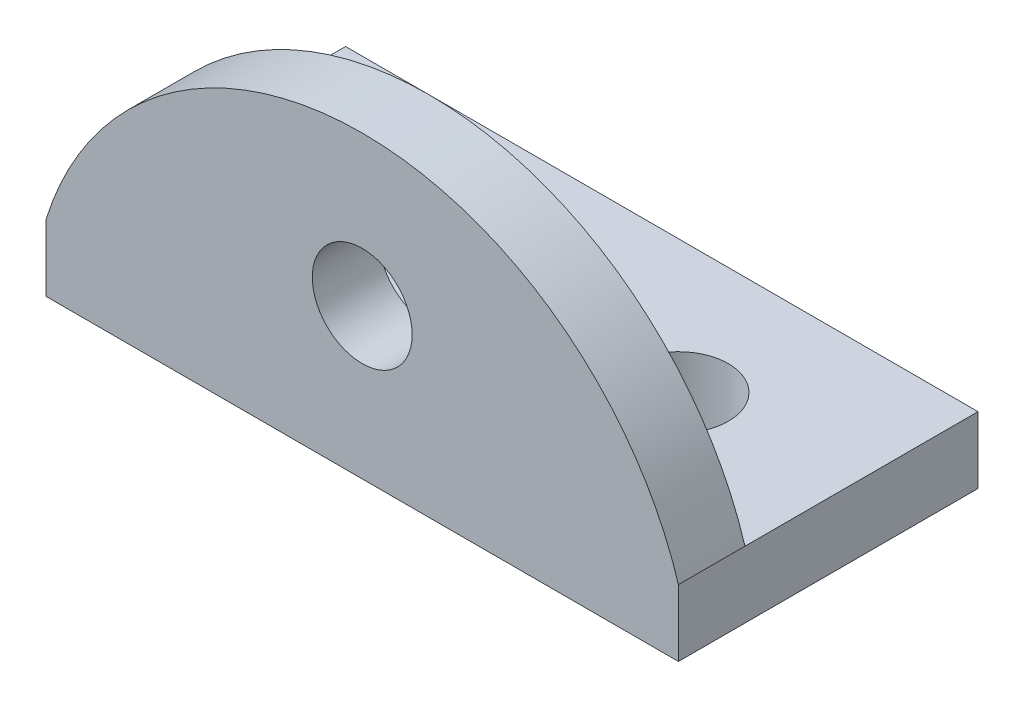
ISO-10303-21;
HEADER;
FILE_DESCRIPTION(('STEP AP214'),'2;1');
FILE_NAME('part.step','',(''),(''),'','','');
FILE_SCHEMA(('AUTOMOTIVE_DESIGN { 1 0 10303 214 1 1 1 1 }'));
ENDSEC;
DATA;
#1=APPLICATION_CONTEXT('core data for automotive mechanical design processes');
#2=APPLICATION_PROTOCOL_DEFINITION('international standard','automotive_design',2000,#1);
#3=PRODUCT_CONTEXT('',#1,'mechanical');
#4=PRODUCT('Part','Part','',(#3));
#5=PRODUCT_RELATED_PRODUCT_CATEGORY('part','',(#4));
#6=PRODUCT_DEFINITION_FORMATION('','',#4);
#7=PRODUCT_DEFINITION_CONTEXT('part definition',#1,'design');
#8=PRODUCT_DEFINITION('design','',#6,#7);
#9=PRODUCT_DEFINITION_SHAPE('','',#8);
#10=(LENGTH_UNIT() NAMED_UNIT(*) SI_UNIT(.MILLI.,.METRE.));
#11=(NAMED_UNIT(*) PLANE_ANGLE_UNIT() SI_UNIT($,.RADIAN.));
#12=(NAMED_UNIT(*) SI_UNIT($,.STERADIAN.) SOLID_ANGLE_UNIT());
#13=UNCERTAINTY_MEASURE_WITH_UNIT(LENGTH_MEASURE(1.E-05),#10,'distance_accuracy_value','');
#14=(GEOMETRIC_REPRESENTATION_CONTEXT(3) GLOBAL_UNCERTAINTY_ASSIGNED_CONTEXT((#13)) GLOBAL_UNIT_ASSIGNED_CONTEXT((#10,
#11,#12)) REPRESENTATION_CONTEXT('',''));
#15=CARTESIAN_POINT('',(0.,0.,0.));
#16=DIRECTION('',(0.,0.,1.));
#17=DIRECTION('',(1.,0.,0.));
#18=AXIS2_PLACEMENT_3D('',#15,#16,#17);
#19=CARTESIAN_POINT('',(0.,2.,0.));
#20=DIRECTION('',(1.,0.,0.));
#21=DIRECTION('',(0.,0.,-1.));
#22=AXIS2_PLACEMENT_3D('',#19,#20,#21);
#23=PLANE('',#22);
#24=DIRECTION('',(0.,0.,1.));
#25=VECTOR('',#24,1.);
#26=CARTESIAN_POINT('',(0.,0.,0.));
#27=LINE('',#26,#25);
#28=CARTESIAN_POINT('',(0.,0.,-9.));
#29=VERTEX_POINT('',#28);
#30=CARTESIAN_POINT('',(0.,0.,0.));
#31=VERTEX_POINT('',#30);
#32=EDGE_CURVE('E108',#29,#31,#27,.T.);
#33=ORIENTED_EDGE('',*,*,#32,.T.);
#34=DIRECTION('',(0.,-1.,0.));
#35=VECTOR('',#34,1.);
#36=CARTESIAN_POINT('',(0.,2.,0.));
#37=LINE('',#36,#35);
#38=CARTESIAN_POINT('',(0.,2.,0.));
#39=VERTEX_POINT('',#38);
#40=EDGE_CURVE('E11',#39,#31,#37,.T.);
#41=ORIENTED_EDGE('',*,*,#40,.F.);
#42=DIRECTION('',(0.,0.,1.));
#43=VECTOR('',#42,1.);
#44=CARTESIAN_POINT('',(0.,2.,-2.));
#45=LINE('',#44,#43);
#46=CARTESIAN_POINT('',(0.,2.,-2.));
#47=VERTEX_POINT('',#46);
#48=EDGE_CURVE('E54',#47,#39,#45,.T.);
#49=ORIENTED_EDGE('',*,*,#48,.F.);
#50=DIRECTION('',(0.,0.,1.));
#51=VECTOR('',#50,1.);
#52=CARTESIAN_POINT('',(0.,2.,0.));
#53=LINE('',#52,#51);
#54=CARTESIAN_POINT('',(0.,2.,-9.));
#55=VERTEX_POINT('',#54);
#56=EDGE_CURVE('E109',#55,#47,#53,.T.);
#57=ORIENTED_EDGE('',*,*,#56,.F.);
#58=DIRECTION('',(0.,-1.,0.));
#59=VECTOR('',#58,1.);
#60=CARTESIAN_POINT('',(0.,2.,-9.));
#61=LINE('',#60,#59);
#62=EDGE_CURVE('E113',#55,#29,#61,.T.);
#63=ORIENTED_EDGE('',*,*,#62,.T.);
#64=EDGE_LOOP('',(#33,#41,#49,#57,#63));
#65=FACE_BOUND('',#64,.T.);
#66=ADVANCED_FACE('F32',(#65),#23,.F.);
#67=CARTESIAN_POINT('',(0.,2.,0.));
#68=DIRECTION('',(0.,0.,-1.));
#69=DIRECTION('',(-1.,0.,0.));
#70=AXIS2_PLACEMENT_3D('',#67,#68,#69);
#71=PLANE('',#70);
#72=CARTESIAN_POINT('',(9.5,4.5,0.));
#73=DIRECTION('',(0.,0.,1.));
#74=DIRECTION('',(1.,0.,0.));
#75=AXIS2_PLACEMENT_3D('',#72,#73,#74);
#76=CIRCLE('',#75,1.5);
#77=CARTESIAN_POINT('',(11.,4.5,0.));
#78=VERTEX_POINT('',#77);
#79=EDGE_CURVE('E179',#78,#78,#76,.T.);
#80=ORIENTED_EDGE('',*,*,#79,.F.);
#81=EDGE_LOOP('',(#80));
#82=FACE_BOUND('',#81,.T.);
#83=DIRECTION('',(1.,0.,0.));
#84=VECTOR('',#83,1.);
#85=CARTESIAN_POINT('',(0.,0.,0.));
#86=LINE('',#85,#84);
#87=CARTESIAN_POINT('',(19.,0.,0.));
#88=VERTEX_POINT('',#87);
#89=EDGE_CURVE('E95',#31,#88,#86,.T.);
#90=ORIENTED_EDGE('',*,*,#89,.T.);
#91=DIRECTION('',(0.,-1.,0.));
#92=VECTOR('',#91,1.);
#93=CARTESIAN_POINT('',(19.,2.,0.));
#94=LINE('',#93,#92);
#95=CARTESIAN_POINT('',(19.,2.,0.));
#96=VERTEX_POINT('',#95);
#97=EDGE_CURVE('E39',#96,#88,#94,.T.);
#98=ORIENTED_EDGE('',*,*,#97,.F.);
#99=CARTESIAN_POINT('',(9.5,-0.946428571428571,0.));
#100=DIRECTION('',(0.,0.,1.));
#101=DIRECTION('',(-1.,0.,0.));
#102=AXIS2_PLACEMENT_3D('',#99,#100,#101);
#103=CIRCLE('',#102,9.94642857142857);
#104=EDGE_CURVE('E94',#96,#39,#103,.T.);
#105=ORIENTED_EDGE('',*,*,#104,.T.);
#106=ORIENTED_EDGE('',*,*,#40,.T.);
#107=EDGE_LOOP('',(#90,#98,#105,#106));
#108=FACE_BOUND('',#107,.T.);
#109=ADVANCED_FACE('F93',(#82,#108),#71,.F.);
#110=CARTESIAN_POINT('',(19.,2.,0.));
#111=DIRECTION('',(-1.,0.,0.));
#112=DIRECTION('',(0.,0.,1.));
#113=AXIS2_PLACEMENT_3D('',#110,#111,#112);
#114=PLANE('',#113);
#115=DIRECTION('',(0.,0.,-1.));
#116=VECTOR('',#115,1.);
#117=CARTESIAN_POINT('',(19.,0.,0.));
#118=LINE('',#117,#116);
#119=CARTESIAN_POINT('',(19.,0.,-9.));
#120=VERTEX_POINT('',#119);
#121=EDGE_CURVE('E117',#88,#120,#118,.T.);
#122=ORIENTED_EDGE('',*,*,#121,.T.);
#123=DIRECTION('',(0.,-1.,0.));
#124=VECTOR('',#123,1.);
#125=CARTESIAN_POINT('',(19.,2.,-9.));
#126=LINE('',#125,#124);
#127=CARTESIAN_POINT('',(19.,2.,-9.));
#128=VERTEX_POINT('',#127);
#129=EDGE_CURVE('E96',#128,#120,#126,.T.);
#130=ORIENTED_EDGE('',*,*,#129,.F.);
#131=DIRECTION('',(0.,0.,-1.));
#132=VECTOR('',#131,1.);
#133=CARTESIAN_POINT('',(19.,2.,0.));
#134=LINE('',#133,#132);
#135=CARTESIAN_POINT('',(19.,2.,-2.));
#136=VERTEX_POINT('',#135);
#137=EDGE_CURVE('E84',#136,#128,#134,.T.);
#138=ORIENTED_EDGE('',*,*,#137,.F.);
#139=EDGE_CURVE('E79',#96,#136,#134,.T.);
#140=ORIENTED_EDGE('',*,*,#139,.F.);
#141=ORIENTED_EDGE('',*,*,#97,.T.);
#142=EDGE_LOOP('',(#122,#130,#138,#140,#141));
#143=FACE_BOUND('',#142,.T.);
#144=ADVANCED_FACE('F81',(#143),#114,.F.);
#145=CARTESIAN_POINT('',(0.,2.,-9.));
#146=DIRECTION('',(0.,0.,1.));
#147=DIRECTION('',(1.,0.,0.));
#148=AXIS2_PLACEMENT_3D('',#145,#146,#147);
#149=PLANE('',#148);
#150=DIRECTION('',(-1.,0.,0.));
#151=VECTOR('',#150,1.);
#152=CARTESIAN_POINT('',(0.,0.,-9.));
#153=LINE('',#152,#151);
#154=EDGE_CURVE('E110',#120,#29,#153,.T.);
#155=ORIENTED_EDGE('',*,*,#154,.T.);
#156=ORIENTED_EDGE('',*,*,#62,.F.);
#157=DIRECTION('',(-1.,0.,0.));
#158=VECTOR('',#157,1.);
#159=CARTESIAN_POINT('',(0.,2.,-9.));
#160=LINE('',#159,#158);
#161=EDGE_CURVE('E89',#128,#55,#160,.T.);
#162=ORIENTED_EDGE('',*,*,#161,.F.);
#163=ORIENTED_EDGE('',*,*,#129,.T.);
#164=EDGE_LOOP('',(#155,#156,#162,#163));
#165=FACE_BOUND('',#164,.T.);
#166=ADVANCED_FACE('F126',(#165),#149,.F.);
#167=CARTESIAN_POINT('',(0.,2.,0.));
#168=DIRECTION('',(0.,-1.,0.));
#169=DIRECTION('',(0.,0.,-1.));
#170=AXIS2_PLACEMENT_3D('',#167,#168,#169);
#171=PLANE('',#170);
#172=CARTESIAN_POINT('',(5.,2.,-5.));
#173=DIRECTION('',(0.,1.,0.));
#174=DIRECTION('',(0.,0.,1.));
#175=AXIS2_PLACEMENT_3D('',#172,#173,#174);
#176=CIRCLE('',#175,1.5);
#177=CARTESIAN_POINT('',(5.,2.,-3.5));
#178=VERTEX_POINT('',#177);
#179=EDGE_CURVE('E103',#178,#178,#176,.T.);
#180=ORIENTED_EDGE('',*,*,#179,.F.);
#181=EDGE_LOOP('',(#180));
#182=FACE_BOUND('',#181,.T.);
#183=CARTESIAN_POINT('',(14.,2.,-5.));
#184=DIRECTION('',(0.,1.,0.));
#185=DIRECTION('',(0.,0.,1.));
#186=AXIS2_PLACEMENT_3D('',#183,#184,#185);
#187=CIRCLE('',#186,1.5);
#188=CARTESIAN_POINT('',(14.,2.,-3.5));
#189=VERTEX_POINT('',#188);
#190=EDGE_CURVE('E172',#189,#189,#187,.T.);
#191=ORIENTED_EDGE('',*,*,#190,.F.);
#192=EDGE_LOOP('',(#191));
#193=FACE_BOUND('',#192,.T.);
#194=ORIENTED_EDGE('',*,*,#56,.T.);
#195=DIRECTION('',(1.,0.,0.));
#196=VECTOR('',#195,1.);
#197=CARTESIAN_POINT('',(0.,2.,-2.));
#198=LINE('',#197,#196);
#199=EDGE_CURVE('E46',#47,#136,#198,.T.);
#200=ORIENTED_EDGE('',*,*,#199,.T.);
#201=ORIENTED_EDGE('',*,*,#137,.T.);
#202=ORIENTED_EDGE('',*,*,#161,.T.);
#203=EDGE_LOOP('',(#194,#200,#201,#202));
#204=FACE_BOUND('',#203,.T.);
#205=ADVANCED_FACE('F131',(#182,#193,#204),#171,.F.);
#206=CARTESIAN_POINT('',(0.,0.,0.));
#207=DIRECTION('',(0.,-1.,0.));
#208=DIRECTION('',(0.,0.,-1.));
#209=AXIS2_PLACEMENT_3D('',#206,#207,#208);
#210=PLANE('',#209);
#211=CARTESIAN_POINT('',(5.,0.,-5.));
#212=DIRECTION('',(0.,1.,0.));
#213=DIRECTION('',(0.,0.,1.));
#214=AXIS2_PLACEMENT_3D('',#211,#212,#213);
#215=CIRCLE('',#214,1.5);
#216=CARTESIAN_POINT('',(5.,0.,-3.5));
#217=VERTEX_POINT('',#216);
#218=EDGE_CURVE('E99',#217,#217,#215,.T.);
#219=ORIENTED_EDGE('',*,*,#218,.T.);
#220=EDGE_LOOP('',(#219));
#221=FACE_BOUND('',#220,.T.);
#222=CARTESIAN_POINT('',(14.,0.,-5.));
#223=DIRECTION('',(0.,1.,0.));
#224=DIRECTION('',(0.,0.,1.));
#225=AXIS2_PLACEMENT_3D('',#222,#223,#224);
#226=CIRCLE('',#225,1.5);
#227=CARTESIAN_POINT('',(14.,0.,-3.5));
#228=VERTEX_POINT('',#227);
#229=EDGE_CURVE('E174',#228,#228,#226,.T.);
#230=ORIENTED_EDGE('',*,*,#229,.T.);
#231=EDGE_LOOP('',(#230));
#232=FACE_BOUND('',#231,.T.);
#233=ORIENTED_EDGE('',*,*,#32,.F.);
#234=ORIENTED_EDGE('',*,*,#154,.F.);
#235=ORIENTED_EDGE('',*,*,#121,.F.);
#236=ORIENTED_EDGE('',*,*,#89,.F.);
#237=EDGE_LOOP('',(#233,#234,#235,#236));
#238=FACE_BOUND('',#237,.T.);
#239=ADVANCED_FACE('F130',(#221,#232,#238),#210,.T.);
#240=CARTESIAN_POINT('',(9.5,-0.946428571428571,-2.));
#241=DIRECTION('',(0.,0.,1.));
#242=DIRECTION('',(1.,0.,0.));
#243=AXIS2_PLACEMENT_3D('',#240,#241,#242);
#244=CYLINDRICAL_SURFACE('',#243,9.94642857142857);
#245=ORIENTED_EDGE('',*,*,#104,.F.);
#246=ORIENTED_EDGE('',*,*,#139,.T.);
#247=CARTESIAN_POINT('',(9.5,-0.946428571428571,-2.));
#248=DIRECTION('',(0.,0.,1.));
#249=DIRECTION('',(-1.,0.,0.));
#250=AXIS2_PLACEMENT_3D('',#247,#248,#249);
#251=CIRCLE('',#250,9.94642857142857);
#252=EDGE_CURVE('E98',#136,#47,#251,.T.);
#253=ORIENTED_EDGE('',*,*,#252,.T.);
#254=ORIENTED_EDGE('',*,*,#48,.T.);
#255=EDGE_LOOP('',(#245,#246,#253,#254));
#256=FACE_BOUND('',#255,.T.);
#257=ADVANCED_FACE('F97',(#256),#244,.T.);
#258=CARTESIAN_POINT('',(9.5,-0.946428571428571,-2.));
#259=DIRECTION('',(0.,0.,-1.));
#260=DIRECTION('',(-1.,0.,0.));
#261=AXIS2_PLACEMENT_3D('',#258,#259,#260);
#262=PLANE('',#261);
#263=CARTESIAN_POINT('',(9.5,4.5,-2.));
#264=DIRECTION('',(0.,0.,1.));
#265=DIRECTION('',(1.,0.,0.));
#266=AXIS2_PLACEMENT_3D('',#263,#264,#265);
#267=CIRCLE('',#266,1.5);
#268=CARTESIAN_POINT('',(11.,4.5,-2.));
#269=VERTEX_POINT('',#268);
#270=EDGE_CURVE('E175',#269,#269,#267,.T.);
#271=ORIENTED_EDGE('',*,*,#270,.T.);
#272=EDGE_LOOP('',(#271));
#273=FACE_BOUND('',#272,.T.);
#274=ORIENTED_EDGE('',*,*,#252,.F.);
#275=ORIENTED_EDGE('',*,*,#199,.F.);
#276=EDGE_LOOP('',(#274,#275));
#277=FACE_BOUND('',#276,.T.);
#278=ADVANCED_FACE('F133',(#273,#277),#262,.T.);
#279=CARTESIAN_POINT('',(14.,0.,-5.));
#280=DIRECTION('',(0.,1.,0.));
#281=DIRECTION('',(0.,0.,1.));
#282=AXIS2_PLACEMENT_3D('',#279,#280,#281);
#283=CYLINDRICAL_SURFACE('',#282,1.5);
#284=ORIENTED_EDGE('',*,*,#229,.F.);
#285=EDGE_LOOP('',(#284));
#286=FACE_BOUND('',#285,.T.);
#287=ORIENTED_EDGE('',*,*,#190,.T.);
#288=EDGE_LOOP('',(#287));
#289=FACE_BOUND('',#288,.T.);
#290=ADVANCED_FACE('F135',(#286,#289),#283,.F.);
#291=CARTESIAN_POINT('',(5.,0.,-5.));
#292=DIRECTION('',(0.,1.,0.));
#293=DIRECTION('',(0.,0.,1.));
#294=AXIS2_PLACEMENT_3D('',#291,#292,#293);
#295=CYLINDRICAL_SURFACE('',#294,1.5);
#296=ORIENTED_EDGE('',*,*,#218,.F.);
#297=EDGE_LOOP('',(#296));
#298=FACE_BOUND('',#297,.T.);
#299=ORIENTED_EDGE('',*,*,#179,.T.);
#300=EDGE_LOOP('',(#299));
#301=FACE_BOUND('',#300,.T.);
#302=ADVANCED_FACE('F142',(#298,#301),#295,.F.);
#303=CARTESIAN_POINT('',(9.5,4.5,-2.));
#304=DIRECTION('',(0.,0.,1.));
#305=DIRECTION('',(1.,0.,0.));
#306=AXIS2_PLACEMENT_3D('',#303,#304,#305);
#307=CYLINDRICAL_SURFACE('',#306,1.5);
#308=ORIENTED_EDGE('',*,*,#270,.F.);
#309=EDGE_LOOP('',(#308));
#310=FACE_BOUND('',#309,.T.);
#311=ORIENTED_EDGE('',*,*,#79,.T.);
#312=EDGE_LOOP('',(#311));
#313=FACE_BOUND('',#312,.T.);
#314=ADVANCED_FACE('F185',(#310,#313),#307,.F.);
#315=CLOSED_SHELL('',(#66,#109,#144,#166,#205,#239,#257,#278,#290,#302,#314));
#316=MANIFOLD_SOLID_BREP('B2',#315);
#317=ADVANCED_BREP_SHAPE_REPRESENTATION('',(#18,#316),#14);
#318=SHAPE_DEFINITION_REPRESENTATION(#9,#317);
ENDSEC;
END-ISO-10303-21;
